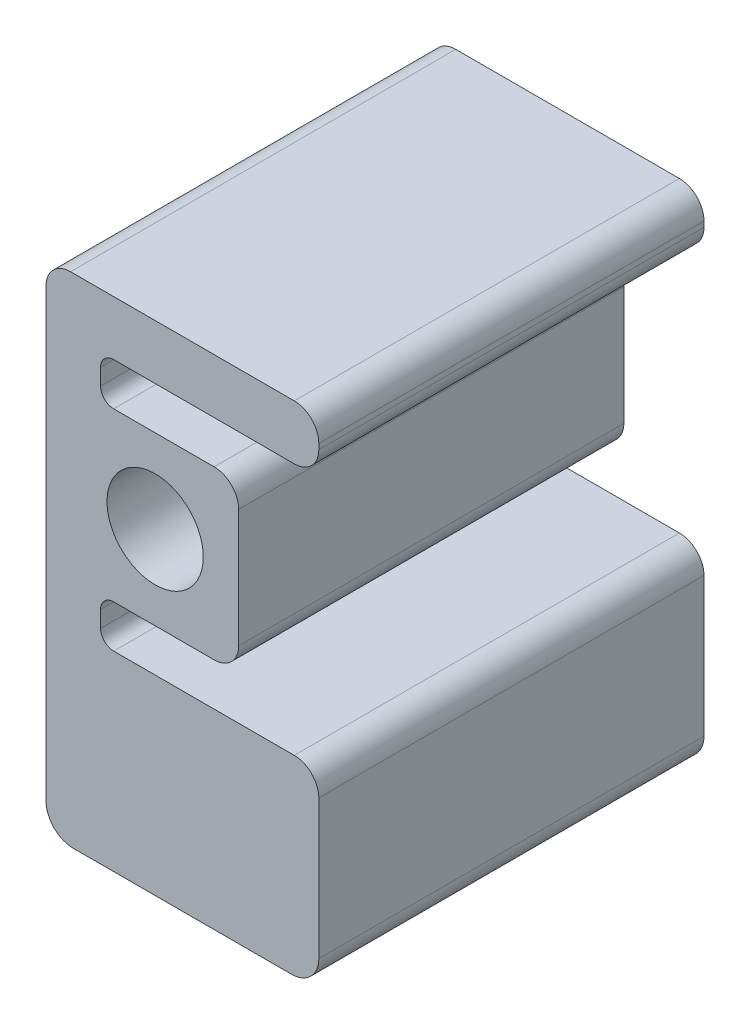
ISO-10303-21;
HEADER;
FILE_DESCRIPTION(('STEP AP214'),'2;1');
FILE_NAME('part.step','',(''),(''),'','','');
FILE_SCHEMA(('AUTOMOTIVE_DESIGN { 1 0 10303 214 1 1 1 1 }'));
ENDSEC;
DATA;
#1=APPLICATION_CONTEXT('core data for automotive mechanical design processes');
#2=APPLICATION_PROTOCOL_DEFINITION('international standard','automotive_design',2000,#1);
#3=PRODUCT_CONTEXT('',#1,'mechanical');
#4=PRODUCT('Part','Part','',(#3));
#5=PRODUCT_RELATED_PRODUCT_CATEGORY('part','',(#4));
#6=PRODUCT_DEFINITION_FORMATION('','',#4);
#7=PRODUCT_DEFINITION_CONTEXT('part definition',#1,'design');
#8=PRODUCT_DEFINITION('design','',#6,#7);
#9=PRODUCT_DEFINITION_SHAPE('','',#8);
#10=(LENGTH_UNIT() NAMED_UNIT(*) SI_UNIT(.MILLI.,.METRE.));
#11=(NAMED_UNIT(*) PLANE_ANGLE_UNIT() SI_UNIT($,.RADIAN.));
#12=(NAMED_UNIT(*) SI_UNIT($,.STERADIAN.) SOLID_ANGLE_UNIT());
#13=UNCERTAINTY_MEASURE_WITH_UNIT(LENGTH_MEASURE(1.E-05),#10,'distance_accuracy_value','');
#14=(GEOMETRIC_REPRESENTATION_CONTEXT(3) GLOBAL_UNCERTAINTY_ASSIGNED_CONTEXT((#13)) GLOBAL_UNIT_ASSIGNED_CONTEXT((#10,
#11,#12)) REPRESENTATION_CONTEXT('',''));
#15=CARTESIAN_POINT('',(0.,0.,0.));
#16=DIRECTION('',(0.,0.,1.));
#17=DIRECTION('',(1.,0.,0.));
#18=AXIS2_PLACEMENT_3D('',#15,#16,#17);
#19=CARTESIAN_POINT('',(-9.65199999999999,-22.503,89.651758212));
#20=DIRECTION('',(0.,0.,-1.));
#21=DIRECTION('',(-1.,0.,0.));
#22=AXIS2_PLACEMENT_3D('',#19,#20,#21);
#23=PLANE('',#22);
#24=DIRECTION('',(1.,0.,0.));
#25=VECTOR('',#24,1.);
#26=CARTESIAN_POINT('',(13.74,-19.455,89.651758212));
#27=LINE('',#26,#25);
#28=CARTESIAN_POINT('',(-9.65199999999999,-19.455,89.651758212));
#29=VERTEX_POINT('',#28);
#30=CARTESIAN_POINT('',(13.74,-19.455,89.651758212));
#31=VERTEX_POINT('',#30);
#32=EDGE_CURVE('E63',#29,#31,#27,.T.);
#33=ORIENTED_EDGE('',*,*,#32,.T.);
#34=CARTESIAN_POINT('',(13.74,-13.74,89.651758212));
#35=DIRECTION('',(0.,0.,1.));
#36=DIRECTION('',(-1.,0.,0.));
#37=AXIS2_PLACEMENT_3D('',#34,#35,#36);
#38=CIRCLE('',#37,5.715);
#39=CARTESIAN_POINT('',(19.455,-13.74,89.651758212));
#40=VERTEX_POINT('',#39);
#41=EDGE_CURVE('E155',#31,#40,#38,.T.);
#42=ORIENTED_EDGE('',*,*,#41,.T.);
#43=DIRECTION('',(0.,1.,0.));
#44=VECTOR('',#43,1.);
#45=CARTESIAN_POINT('',(19.455,0.,89.651758212));
#46=LINE('',#45,#44);
#47=CARTESIAN_POINT('',(19.455,13.74,89.651758212));
#48=VERTEX_POINT('',#47);
#49=EDGE_CURVE('E402',#40,#48,#46,.T.);
#50=ORIENTED_EDGE('',*,*,#49,.T.);
#51=CARTESIAN_POINT('',(13.74,13.74,89.651758212));
#52=DIRECTION('',(0.,0.,1.));
#53=DIRECTION('',(-1.,0.,0.));
#54=AXIS2_PLACEMENT_3D('',#51,#52,#53);
#55=CIRCLE('',#54,5.715);
#56=CARTESIAN_POINT('',(13.74,19.455,89.651758212));
#57=VERTEX_POINT('',#56);
#58=EDGE_CURVE('E422',#48,#57,#55,.T.);
#59=ORIENTED_EDGE('',*,*,#58,.T.);
#60=DIRECTION('',(-1.,0.,0.));
#61=VECTOR('',#60,1.);
#62=CARTESIAN_POINT('',(0.,19.455,89.651758212));
#63=LINE('',#62,#61);
#64=CARTESIAN_POINT('',(-9.65199999999999,19.455,89.651758212));
#65=VERTEX_POINT('',#64);
#66=EDGE_CURVE('E418',#57,#65,#63,.T.);
#67=ORIENTED_EDGE('',*,*,#66,.T.);
#68=CARTESIAN_POINT('',(-9.65199999999999,22.503,89.651758212));
#69=DIRECTION('',(0.,0.,-1.));
#70=DIRECTION('',(-1.,0.,0.));
#71=AXIS2_PLACEMENT_3D('',#68,#69,#70);
#72=CIRCLE('',#71,3.048);
#73=CARTESIAN_POINT('',(-12.7,22.503,89.651758212));
#74=VERTEX_POINT('',#73);
#75=EDGE_CURVE('E421',#65,#74,#72,.T.);
#76=ORIENTED_EDGE('',*,*,#75,.T.);
#77=DIRECTION('',(0.,1.,0.));
#78=VECTOR('',#77,1.);
#79=CARTESIAN_POINT('',(-12.7,22.503,89.651758212));
#80=LINE('',#79,#78);
#81=CARTESIAN_POINT('',(-12.7,26.332,89.651758212));
#82=VERTEX_POINT('',#81);
#83=EDGE_CURVE('E426',#74,#82,#80,.T.);
#84=ORIENTED_EDGE('',*,*,#83,.T.);
#85=CARTESIAN_POINT('',(-9.65199999999999,26.332,89.651758212));
#86=DIRECTION('',(0.,0.,-1.));
#87=DIRECTION('',(-1.,0.,0.));
#88=AXIS2_PLACEMENT_3D('',#85,#86,#87);
#89=CIRCLE('',#88,3.048);
#90=CARTESIAN_POINT('',(-9.65199999999999,29.38,89.651758212));
#91=VERTEX_POINT('',#90);
#92=EDGE_CURVE('E433',#82,#91,#89,.T.);
#93=ORIENTED_EDGE('',*,*,#92,.T.);
#94=DIRECTION('',(1.,0.,0.));
#95=VECTOR('',#94,1.);
#96=CARTESIAN_POINT('',(-9.65199999999999,29.38,89.651758212));
#97=LINE('',#96,#95);
#98=CARTESIAN_POINT('',(32.385,29.38,89.651758212));
#99=VERTEX_POINT('',#98);
#100=EDGE_CURVE('E436',#91,#99,#97,.T.);
#101=ORIENTED_EDGE('',*,*,#100,.T.);
#102=CARTESIAN_POINT('',(32.385,35.095,89.651758212));
#103=DIRECTION('',(0.,0.,1.));
#104=DIRECTION('',(1.,0.,0.));
#105=AXIS2_PLACEMENT_3D('',#102,#103,#104);
#106=CIRCLE('',#105,5.715);
#107=CARTESIAN_POINT('',(38.1,35.095,89.651758212));
#108=VERTEX_POINT('',#107);
#109=EDGE_CURVE('E439',#99,#108,#106,.T.);
#110=ORIENTED_EDGE('',*,*,#109,.T.);
#111=DIRECTION('',(0.,1.,0.));
#112=VECTOR('',#111,1.);
#113=CARTESIAN_POINT('',(38.1,35.095,89.651758212));
#114=LINE('',#113,#112);
#115=CARTESIAN_POINT('',(38.1,36.365,89.651758212));
#116=VERTEX_POINT('',#115);
#117=EDGE_CURVE('E442',#108,#116,#114,.T.);
#118=ORIENTED_EDGE('',*,*,#117,.T.);
#119=CARTESIAN_POINT('',(32.385,36.365,89.651758212));
#120=DIRECTION('',(0.,0.,1.));
#121=DIRECTION('',(1.,0.,0.));
#122=AXIS2_PLACEMENT_3D('',#119,#120,#121);
#123=CIRCLE('',#122,5.715);
#124=CARTESIAN_POINT('',(32.385,42.08,89.651758212));
#125=VERTEX_POINT('',#124);
#126=EDGE_CURVE('E445',#116,#125,#123,.T.);
#127=ORIENTED_EDGE('',*,*,#126,.T.);
#128=DIRECTION('',(-1.,0.,0.));
#129=VECTOR('',#128,1.);
#130=CARTESIAN_POINT('',(32.385,42.08,89.651758212));
#131=LINE('',#130,#129);
#132=CARTESIAN_POINT('',(-19.685,42.08,89.651758212));
#133=VERTEX_POINT('',#132);
#134=EDGE_CURVE('E448',#125,#133,#131,.T.);
#135=ORIENTED_EDGE('',*,*,#134,.T.);
#136=CARTESIAN_POINT('',(-19.685,36.365,89.651758212));
#137=DIRECTION('',(0.,0.,1.));
#138=DIRECTION('',(1.,0.,0.));
#139=AXIS2_PLACEMENT_3D('',#136,#137,#138);
#140=CIRCLE('',#139,5.71499999999999);
#141=CARTESIAN_POINT('',(-25.4,36.365,89.651758212));
#142=VERTEX_POINT('',#141);
#143=EDGE_CURVE('E451',#133,#142,#140,.T.);
#144=ORIENTED_EDGE('',*,*,#143,.T.);
#145=DIRECTION('',(0.,-1.,0.));
#146=VECTOR('',#145,1.);
#147=CARTESIAN_POINT('',(-25.4,-67.4799999619999,89.651758212));
#148=LINE('',#147,#146);
#149=CARTESIAN_POINT('',(-25.4,-67.479999962,89.651758212));
#150=VERTEX_POINT('',#149);
#151=EDGE_CURVE('E454',#142,#150,#148,.T.);
#152=ORIENTED_EDGE('',*,*,#151,.T.);
#153=CARTESIAN_POINT('',(-19.05,-67.479999962,89.651758212));
#154=DIRECTION('',(0.,0.,1.));
#155=DIRECTION('',(-1.,0.,0.));
#156=AXIS2_PLACEMENT_3D('',#153,#154,#155);
#157=CIRCLE('',#156,6.35);
#158=CARTESIAN_POINT('',(-19.0499999999999,-73.829999962,89.651758212));
#159=VERTEX_POINT('',#158);
#160=EDGE_CURVE('E457',#150,#159,#157,.T.);
#161=ORIENTED_EDGE('',*,*,#160,.T.);
#162=DIRECTION('',(1.,0.,0.));
#163=VECTOR('',#162,1.);
#164=CARTESIAN_POINT('',(31.75,-73.829999962,89.651758212));
#165=LINE('',#164,#163);
#166=CARTESIAN_POINT('',(31.75,-73.829999962,89.651758212));
#167=VERTEX_POINT('',#166);
#168=EDGE_CURVE('E460',#159,#167,#165,.T.);
#169=ORIENTED_EDGE('',*,*,#168,.T.);
#170=CARTESIAN_POINT('',(31.75,-67.479999962,89.651758212));
#171=DIRECTION('',(0.,0.,1.));
#172=DIRECTION('',(1.,0.,0.));
#173=AXIS2_PLACEMENT_3D('',#170,#171,#172);
#174=CIRCLE('',#173,6.35);
#175=CARTESIAN_POINT('',(38.1,-67.4799999619999,89.651758212));
#176=VERTEX_POINT('',#175);
#177=EDGE_CURVE('E463',#167,#176,#174,.T.);
#178=ORIENTED_EDGE('',*,*,#177,.T.);
#179=DIRECTION('',(0.,1.,0.));
#180=VECTOR('',#179,1.);
#181=CARTESIAN_POINT('',(38.1,-67.4799999619999,89.651758212));
#182=LINE('',#181,#180);
#183=CARTESIAN_POINT('',(38.1,-35.094999962,89.651758212));
#184=VERTEX_POINT('',#183);
#185=EDGE_CURVE('E466',#176,#184,#182,.T.);
#186=ORIENTED_EDGE('',*,*,#185,.T.);
#187=CARTESIAN_POINT('',(32.385,-35.094999962,89.651758212));
#188=DIRECTION('',(0.,0.,1.));
#189=DIRECTION('',(1.,0.,0.));
#190=AXIS2_PLACEMENT_3D('',#187,#188,#189);
#191=CIRCLE('',#190,5.71499999999999);
#192=CARTESIAN_POINT('',(32.385,-29.379999962,89.651758212));
#193=VERTEX_POINT('',#192);
#194=EDGE_CURVE('E469',#184,#193,#191,.T.);
#195=ORIENTED_EDGE('',*,*,#194,.T.);
#196=DIRECTION('',(-1.,0.,0.));
#197=VECTOR('',#196,1.);
#198=CARTESIAN_POINT('',(32.385,-29.379999962,89.651758212));
#199=LINE('',#198,#197);
#200=CARTESIAN_POINT('',(-9.65199999999999,-29.379999962,89.651758212));
#201=VERTEX_POINT('',#200);
#202=EDGE_CURVE('E223',#193,#201,#199,.T.);
#203=ORIENTED_EDGE('',*,*,#202,.T.);
#204=CARTESIAN_POINT('',(-9.65199999999999,-26.331999962,89.651758212));
#205=DIRECTION('',(0.,0.,-1.));
#206=DIRECTION('',(-1.,0.,0.));
#207=AXIS2_PLACEMENT_3D('',#204,#205,#206);
#208=CIRCLE('',#207,3.048);
#209=CARTESIAN_POINT('',(-12.7,-26.331999962,89.651758212));
#210=VERTEX_POINT('',#209);
#211=EDGE_CURVE('E217',#201,#210,#208,.T.);
#212=ORIENTED_EDGE('',*,*,#211,.T.);
#213=DIRECTION('',(0.,1.,0.));
#214=VECTOR('',#213,1.);
#215=CARTESIAN_POINT('',(-12.7,-26.331999962,89.651758212));
#216=LINE('',#215,#214);
#217=CARTESIAN_POINT('',(-12.7,-22.503,89.651758212));
#218=VERTEX_POINT('',#217);
#219=EDGE_CURVE('E221',#210,#218,#216,.T.);
#220=ORIENTED_EDGE('',*,*,#219,.T.);
#221=CARTESIAN_POINT('',(-9.65199999999999,-22.503,89.651758212));
#222=DIRECTION('',(0.,0.,-1.));
#223=DIRECTION('',(-1.,0.,0.));
#224=AXIS2_PLACEMENT_3D('',#221,#222,#223);
#225=CIRCLE('',#224,3.048);
#226=EDGE_CURVE('E240',#218,#29,#225,.T.);
#227=ORIENTED_EDGE('',*,*,#226,.T.);
#228=EDGE_LOOP('',(#33,#42,#50,#59,#67,#76,#84,#93,#101,#110,#118,#127,#135,#144,#152,#161,#169,
#178,#186,#195,#203,#212,#220,#227));
#229=FACE_BOUND('',#228,.T.);
#230=CARTESIAN_POINT('',(0.,0.,89.651758212));
#231=DIRECTION('',(0.,0.,1.));
#232=DIRECTION('',(1.,0.,0.));
#233=AXIS2_PLACEMENT_3D('',#230,#231,#232);
#234=CIRCLE('',#233,11.2);
#235=CARTESIAN_POINT('',(11.2,0.,89.651758212));
#236=VERTEX_POINT('',#235);
#237=EDGE_CURVE('E252',#236,#236,#234,.T.);
#238=ORIENTED_EDGE('',*,*,#237,.F.);
#239=EDGE_LOOP('',(#238));
#240=FACE_BOUND('',#239,.T.);
#241=ADVANCED_FACE('F45',(#229,#240),#23,.F.);
#242=CARTESIAN_POINT('',(-9.65199999999999,-22.503,0.));
#243=DIRECTION('',(0.,0.,-1.));
#244=DIRECTION('',(-1.,0.,0.));
#245=AXIS2_PLACEMENT_3D('',#242,#243,#244);
#246=PLANE('',#245);
#247=CARTESIAN_POINT('',(13.74,-13.74,0.));
#248=DIRECTION('',(0.,0.,1.));
#249=DIRECTION('',(-1.,0.,0.));
#250=AXIS2_PLACEMENT_3D('',#247,#248,#249);
#251=CIRCLE('',#250,5.715);
#252=CARTESIAN_POINT('',(13.74,-19.455,0.));
#253=VERTEX_POINT('',#252);
#254=CARTESIAN_POINT('',(19.455,-13.74,0.));
#255=VERTEX_POINT('',#254);
#256=EDGE_CURVE('E247',#253,#255,#251,.T.);
#257=ORIENTED_EDGE('',*,*,#256,.F.);
#258=DIRECTION('',(1.,0.,0.));
#259=VECTOR('',#258,1.);
#260=CARTESIAN_POINT('',(-9.65199999999999,-19.455,0.));
#261=LINE('',#260,#259);
#262=CARTESIAN_POINT('',(-9.65199999999999,-19.455,0.));
#263=VERTEX_POINT('',#262);
#264=EDGE_CURVE('E316',#263,#253,#261,.T.);
#265=ORIENTED_EDGE('',*,*,#264,.F.);
#266=CARTESIAN_POINT('',(-9.65199999999999,-22.503,0.));
#267=DIRECTION('',(0.,0.,-1.));
#268=DIRECTION('',(-1.,0.,0.));
#269=AXIS2_PLACEMENT_3D('',#266,#267,#268);
#270=CIRCLE('',#269,3.048);
#271=CARTESIAN_POINT('',(-12.7,-22.503,0.));
#272=VERTEX_POINT('',#271);
#273=EDGE_CURVE('E148',#272,#263,#270,.T.);
#274=ORIENTED_EDGE('',*,*,#273,.F.);
#275=DIRECTION('',(0.,1.,0.));
#276=VECTOR('',#275,1.);
#277=CARTESIAN_POINT('',(-12.7,-26.331999962,0.));
#278=LINE('',#277,#276);
#279=CARTESIAN_POINT('',(-12.7,-26.331999962,0.));
#280=VERTEX_POINT('',#279);
#281=EDGE_CURVE('E141',#280,#272,#278,.T.);
#282=ORIENTED_EDGE('',*,*,#281,.F.);
#283=CARTESIAN_POINT('',(-9.65199999999999,-26.331999962,0.));
#284=DIRECTION('',(0.,0.,-1.));
#285=DIRECTION('',(-1.,0.,0.));
#286=AXIS2_PLACEMENT_3D('',#283,#284,#285);
#287=CIRCLE('',#286,3.048);
#288=CARTESIAN_POINT('',(-9.65199999999999,-29.379999962,0.));
#289=VERTEX_POINT('',#288);
#290=EDGE_CURVE('E232',#289,#280,#287,.T.);
#291=ORIENTED_EDGE('',*,*,#290,.F.);
#292=DIRECTION('',(-1.,0.,0.));
#293=VECTOR('',#292,1.);
#294=CARTESIAN_POINT('',(32.385,-29.379999962,0.));
#295=LINE('',#294,#293);
#296=CARTESIAN_POINT('',(32.385,-29.379999962,0.));
#297=VERTEX_POINT('',#296);
#298=EDGE_CURVE('E307',#297,#289,#295,.T.);
#299=ORIENTED_EDGE('',*,*,#298,.F.);
#300=CARTESIAN_POINT('',(32.385,-35.094999962,0.));
#301=DIRECTION('',(0.,0.,1.));
#302=DIRECTION('',(1.,0.,0.));
#303=AXIS2_PLACEMENT_3D('',#300,#301,#302);
#304=CIRCLE('',#303,5.71499999999999);
#305=CARTESIAN_POINT('',(38.1,-35.094999962,0.));
#306=VERTEX_POINT('',#305);
#307=EDGE_CURVE('E304',#306,#297,#304,.T.);
#308=ORIENTED_EDGE('',*,*,#307,.F.);
#309=DIRECTION('',(0.,1.,0.));
#310=VECTOR('',#309,1.);
#311=CARTESIAN_POINT('',(38.1,-67.4799999619999,0.));
#312=LINE('',#311,#310);
#313=CARTESIAN_POINT('',(38.1,-67.4799999619999,0.));
#314=VERTEX_POINT('',#313);
#315=EDGE_CURVE('E301',#314,#306,#312,.T.);
#316=ORIENTED_EDGE('',*,*,#315,.F.);
#317=CARTESIAN_POINT('',(31.75,-67.479999962,0.));
#318=DIRECTION('',(0.,0.,1.));
#319=DIRECTION('',(1.,0.,0.));
#320=AXIS2_PLACEMENT_3D('',#317,#318,#319);
#321=CIRCLE('',#320,6.35);
#322=CARTESIAN_POINT('',(31.75,-73.829999962,0.));
#323=VERTEX_POINT('',#322);
#324=EDGE_CURVE('E298',#323,#314,#321,.T.);
#325=ORIENTED_EDGE('',*,*,#324,.F.);
#326=DIRECTION('',(1.,0.,0.));
#327=VECTOR('',#326,1.);
#328=CARTESIAN_POINT('',(31.75,-73.829999962,0.));
#329=LINE('',#328,#327);
#330=CARTESIAN_POINT('',(-19.0499999999999,-73.829999962,0.));
#331=VERTEX_POINT('',#330);
#332=EDGE_CURVE('E295',#331,#323,#329,.T.);
#333=ORIENTED_EDGE('',*,*,#332,.F.);
#334=CARTESIAN_POINT('',(-19.05,-67.479999962,0.));
#335=DIRECTION('',(0.,0.,1.));
#336=DIRECTION('',(-1.,0.,0.));
#337=AXIS2_PLACEMENT_3D('',#334,#335,#336);
#338=CIRCLE('',#337,6.35);
#339=CARTESIAN_POINT('',(-25.4,-67.479999962,0.));
#340=VERTEX_POINT('',#339);
#341=EDGE_CURVE('E292',#340,#331,#338,.T.);
#342=ORIENTED_EDGE('',*,*,#341,.F.);
#343=DIRECTION('',(0.,-1.,0.));
#344=VECTOR('',#343,1.);
#345=CARTESIAN_POINT('',(-25.4,-67.4799999619999,0.));
#346=LINE('',#345,#344);
#347=CARTESIAN_POINT('',(-25.4,36.365,0.));
#348=VERTEX_POINT('',#347);
#349=EDGE_CURVE('E289',#348,#340,#346,.T.);
#350=ORIENTED_EDGE('',*,*,#349,.F.);
#351=CARTESIAN_POINT('',(-19.685,36.365,0.));
#352=DIRECTION('',(0.,0.,1.));
#353=DIRECTION('',(1.,0.,0.));
#354=AXIS2_PLACEMENT_3D('',#351,#352,#353);
#355=CIRCLE('',#354,5.71499999999999);
#356=CARTESIAN_POINT('',(-19.685,42.08,0.));
#357=VERTEX_POINT('',#356);
#358=EDGE_CURVE('E286',#357,#348,#355,.T.);
#359=ORIENTED_EDGE('',*,*,#358,.F.);
#360=DIRECTION('',(-1.,0.,0.));
#361=VECTOR('',#360,1.);
#362=CARTESIAN_POINT('',(32.385,42.08,0.));
#363=LINE('',#362,#361);
#364=CARTESIAN_POINT('',(32.385,42.08,0.));
#365=VERTEX_POINT('',#364);
#366=EDGE_CURVE('E283',#365,#357,#363,.T.);
#367=ORIENTED_EDGE('',*,*,#366,.F.);
#368=CARTESIAN_POINT('',(32.385,36.365,0.));
#369=DIRECTION('',(0.,0.,1.));
#370=DIRECTION('',(1.,0.,0.));
#371=AXIS2_PLACEMENT_3D('',#368,#369,#370);
#372=CIRCLE('',#371,5.715);
#373=CARTESIAN_POINT('',(38.1,36.365,0.));
#374=VERTEX_POINT('',#373);
#375=EDGE_CURVE('E280',#374,#365,#372,.T.);
#376=ORIENTED_EDGE('',*,*,#375,.F.);
#377=DIRECTION('',(0.,1.,0.));
#378=VECTOR('',#377,1.);
#379=CARTESIAN_POINT('',(38.1,35.095,0.));
#380=LINE('',#379,#378);
#381=CARTESIAN_POINT('',(38.1,35.095,0.));
#382=VERTEX_POINT('',#381);
#383=EDGE_CURVE('E277',#382,#374,#380,.T.);
#384=ORIENTED_EDGE('',*,*,#383,.F.);
#385=CARTESIAN_POINT('',(32.385,35.095,0.));
#386=DIRECTION('',(0.,0.,1.));
#387=DIRECTION('',(1.,0.,0.));
#388=AXIS2_PLACEMENT_3D('',#385,#386,#387);
#389=CIRCLE('',#388,5.715);
#390=CARTESIAN_POINT('',(32.385,29.38,0.));
#391=VERTEX_POINT('',#390);
#392=EDGE_CURVE('E274',#391,#382,#389,.T.);
#393=ORIENTED_EDGE('',*,*,#392,.F.);
#394=DIRECTION('',(1.,0.,0.));
#395=VECTOR('',#394,1.);
#396=CARTESIAN_POINT('',(-9.65199999999999,29.38,0.));
#397=LINE('',#396,#395);
#398=CARTESIAN_POINT('',(-9.65199999999999,29.38,0.));
#399=VERTEX_POINT('',#398);
#400=EDGE_CURVE('E271',#399,#391,#397,.T.);
#401=ORIENTED_EDGE('',*,*,#400,.F.);
#402=CARTESIAN_POINT('',(-9.65199999999999,26.332,0.));
#403=DIRECTION('',(0.,0.,-1.));
#404=DIRECTION('',(-1.,0.,0.));
#405=AXIS2_PLACEMENT_3D('',#402,#403,#404);
#406=CIRCLE('',#405,3.048);
#407=CARTESIAN_POINT('',(-12.7,26.332,0.));
#408=VERTEX_POINT('',#407);
#409=EDGE_CURVE('E268',#408,#399,#406,.T.);
#410=ORIENTED_EDGE('',*,*,#409,.F.);
#411=DIRECTION('',(0.,1.,0.));
#412=VECTOR('',#411,1.);
#413=CARTESIAN_POINT('',(-12.7,22.503,0.));
#414=LINE('',#413,#412);
#415=CARTESIAN_POINT('',(-12.7,22.503,0.));
#416=VERTEX_POINT('',#415);
#417=EDGE_CURVE('E265',#416,#408,#414,.T.);
#418=ORIENTED_EDGE('',*,*,#417,.F.);
#419=CARTESIAN_POINT('',(-9.65199999999999,22.503,0.));
#420=DIRECTION('',(0.,0.,-1.));
#421=DIRECTION('',(-1.,0.,0.));
#422=AXIS2_PLACEMENT_3D('',#419,#420,#421);
#423=CIRCLE('',#422,3.048);
#424=CARTESIAN_POINT('',(-9.65199999999999,19.455,0.));
#425=VERTEX_POINT('',#424);
#426=EDGE_CURVE('E262',#425,#416,#423,.T.);
#427=ORIENTED_EDGE('',*,*,#426,.F.);
#428=DIRECTION('',(-1.,0.,0.));
#429=VECTOR('',#428,1.);
#430=CARTESIAN_POINT('',(-9.65199999999999,19.455,0.));
#431=LINE('',#430,#429);
#432=CARTESIAN_POINT('',(13.74,19.455,0.));
#433=VERTEX_POINT('',#432);
#434=EDGE_CURVE('E259',#433,#425,#431,.T.);
#435=ORIENTED_EDGE('',*,*,#434,.F.);
#436=CARTESIAN_POINT('',(13.74,13.74,0.));
#437=DIRECTION('',(0.,0.,1.));
#438=DIRECTION('',(-1.,0.,0.));
#439=AXIS2_PLACEMENT_3D('',#436,#437,#438);
#440=CIRCLE('',#439,5.715);
#441=CARTESIAN_POINT('',(19.455,13.74,0.));
#442=VERTEX_POINT('',#441);
#443=EDGE_CURVE('E255',#442,#433,#440,.T.);
#444=ORIENTED_EDGE('',*,*,#443,.F.);
#445=DIRECTION('',(0.,1.,0.));
#446=VECTOR('',#445,1.);
#447=CARTESIAN_POINT('',(19.455,13.74,0.));
#448=LINE('',#447,#446);
#449=EDGE_CURVE('E251',#255,#442,#448,.T.);
#450=ORIENTED_EDGE('',*,*,#449,.F.);
#451=EDGE_LOOP('',(#257,#265,#274,#282,#291,#299,#308,#316,#325,#333,#342,#350,#359,#367,#376,
#384,#393,#401,#410,#418,#427,#435,#444,#450));
#452=FACE_BOUND('',#451,.T.);
#453=CARTESIAN_POINT('',(0.,0.,0.));
#454=DIRECTION('',(0.,0.,1.));
#455=DIRECTION('',(1.,0.,0.));
#456=AXIS2_PLACEMENT_3D('',#453,#454,#455);
#457=CIRCLE('',#456,11.2);
#458=CARTESIAN_POINT('',(11.2,0.,0.));
#459=VERTEX_POINT('',#458);
#460=EDGE_CURVE('E780',#459,#459,#457,.T.);
#461=ORIENTED_EDGE('',*,*,#460,.T.);
#462=EDGE_LOOP('',(#461));
#463=FACE_BOUND('',#462,.T.);
#464=ADVANCED_FACE('F406',(#452,#463),#246,.T.);
#465=CARTESIAN_POINT('',(13.74,-13.74,89.651758212));
#466=DIRECTION('',(0.,0.,-1.));
#467=DIRECTION('',(-1.,0.,0.));
#468=AXIS2_PLACEMENT_3D('',#465,#466,#467);
#469=CYLINDRICAL_SURFACE('',#468,5.715);
#470=ORIENTED_EDGE('',*,*,#256,.T.);
#471=DIRECTION('',(0.,0.,-1.));
#472=VECTOR('',#471,1.);
#473=CARTESIAN_POINT('',(19.455,-13.74,89.651758212));
#474=LINE('',#473,#472);
#475=EDGE_CURVE('E55',#40,#255,#474,.T.);
#476=ORIENTED_EDGE('',*,*,#475,.F.);
#477=ORIENTED_EDGE('',*,*,#41,.F.);
#478=DIRECTION('',(0.,0.,-1.));
#479=VECTOR('',#478,1.);
#480=CARTESIAN_POINT('',(13.74,-19.455,89.651758212));
#481=LINE('',#480,#479);
#482=EDGE_CURVE('E11',#31,#253,#481,.T.);
#483=ORIENTED_EDGE('',*,*,#482,.T.);
#484=EDGE_LOOP('',(#470,#476,#477,#483));
#485=FACE_BOUND('',#484,.T.);
#486=ADVANCED_FACE('F47',(#485),#469,.T.);
#487=CARTESIAN_POINT('',(19.455,13.74,89.651758212));
#488=DIRECTION('',(-1.,0.,0.));
#489=DIRECTION('',(0.,0.,1.));
#490=AXIS2_PLACEMENT_3D('',#487,#488,#489);
#491=PLANE('',#490);
#492=ORIENTED_EDGE('',*,*,#449,.T.);
#493=DIRECTION('',(0.,0.,-1.));
#494=VECTOR('',#493,1.);
#495=CARTESIAN_POINT('',(19.455,13.74,89.651758212));
#496=LINE('',#495,#494);
#497=EDGE_CURVE('E393',#48,#442,#496,.T.);
#498=ORIENTED_EDGE('',*,*,#497,.F.);
#499=ORIENTED_EDGE('',*,*,#49,.F.);
#500=ORIENTED_EDGE('',*,*,#475,.T.);
#501=EDGE_LOOP('',(#492,#498,#499,#500));
#502=FACE_BOUND('',#501,.T.);
#503=ADVANCED_FACE('F400',(#502),#491,.F.);
#504=CARTESIAN_POINT('',(13.74,13.74,89.651758212));
#505=DIRECTION('',(0.,0.,-1.));
#506=DIRECTION('',(-1.,0.,0.));
#507=AXIS2_PLACEMENT_3D('',#504,#505,#506);
#508=CYLINDRICAL_SURFACE('',#507,5.715);
#509=ORIENTED_EDGE('',*,*,#443,.T.);
#510=DIRECTION('',(0.,0.,-1.));
#511=VECTOR('',#510,1.);
#512=CARTESIAN_POINT('',(13.74,19.455,89.651758212));
#513=LINE('',#512,#511);
#514=EDGE_CURVE('E389',#57,#433,#513,.T.);
#515=ORIENTED_EDGE('',*,*,#514,.F.);
#516=ORIENTED_EDGE('',*,*,#58,.F.);
#517=ORIENTED_EDGE('',*,*,#497,.T.);
#518=EDGE_LOOP('',(#509,#515,#516,#517));
#519=FACE_BOUND('',#518,.T.);
#520=ADVANCED_FACE('F412',(#519),#508,.T.);
#521=CARTESIAN_POINT('',(-9.65199999999999,19.455,89.651758212));
#522=DIRECTION('',(0.,-1.,0.));
#523=DIRECTION('',(1.,0.,0.));
#524=AXIS2_PLACEMENT_3D('',#521,#522,#523);
#525=PLANE('',#524);
#526=ORIENTED_EDGE('',*,*,#434,.T.);
#527=DIRECTION('',(0.,0.,-1.));
#528=VECTOR('',#527,1.);
#529=CARTESIAN_POINT('',(-9.65199999999999,19.455,89.651758212));
#530=LINE('',#529,#528);
#531=EDGE_CURVE('E385',#65,#425,#530,.T.);
#532=ORIENTED_EDGE('',*,*,#531,.F.);
#533=ORIENTED_EDGE('',*,*,#66,.F.);
#534=ORIENTED_EDGE('',*,*,#514,.T.);
#535=EDGE_LOOP('',(#526,#532,#533,#534));
#536=FACE_BOUND('',#535,.T.);
#537=ADVANCED_FACE('F416',(#536),#525,.F.);
#538=CARTESIAN_POINT('',(-9.65199999999999,22.503,89.651758212));
#539=DIRECTION('',(0.,0.,-1.));
#540=DIRECTION('',(-1.,0.,0.));
#541=AXIS2_PLACEMENT_3D('',#538,#539,#540);
#542=CYLINDRICAL_SURFACE('',#541,3.048);
#543=ORIENTED_EDGE('',*,*,#426,.T.);
#544=DIRECTION('',(0.,0.,-1.));
#545=VECTOR('',#544,1.);
#546=CARTESIAN_POINT('',(-12.7,22.503,89.651758212));
#547=LINE('',#546,#545);
#548=EDGE_CURVE('E381',#74,#416,#547,.T.);
#549=ORIENTED_EDGE('',*,*,#548,.F.);
#550=ORIENTED_EDGE('',*,*,#75,.F.);
#551=ORIENTED_EDGE('',*,*,#531,.T.);
#552=EDGE_LOOP('',(#543,#549,#550,#551));
#553=FACE_BOUND('',#552,.T.);
#554=ADVANCED_FACE('F547',(#553),#542,.F.);
#555=CARTESIAN_POINT('',(-12.7,22.503,89.651758212));
#556=DIRECTION('',(-1.,0.,0.));
#557=DIRECTION('',(0.,0.,1.));
#558=AXIS2_PLACEMENT_3D('',#555,#556,#557);
#559=PLANE('',#558);
#560=ORIENTED_EDGE('',*,*,#417,.T.);
#561=DIRECTION('',(0.,0.,-1.));
#562=VECTOR('',#561,1.);
#563=CARTESIAN_POINT('',(-12.7,26.332,89.651758212));
#564=LINE('',#563,#562);
#565=EDGE_CURVE('E377',#82,#408,#564,.T.);
#566=ORIENTED_EDGE('',*,*,#565,.F.);
#567=ORIENTED_EDGE('',*,*,#83,.F.);
#568=ORIENTED_EDGE('',*,*,#548,.T.);
#569=EDGE_LOOP('',(#560,#566,#567,#568));
#570=FACE_BOUND('',#569,.T.);
#571=ADVANCED_FACE('F543',(#570),#559,.F.);
#572=CARTESIAN_POINT('',(-9.65199999999999,26.332,89.651758212));
#573=DIRECTION('',(0.,0.,-1.));
#574=DIRECTION('',(-1.,0.,0.));
#575=AXIS2_PLACEMENT_3D('',#572,#573,#574);
#576=CYLINDRICAL_SURFACE('',#575,3.048);
#577=ORIENTED_EDGE('',*,*,#409,.T.);
#578=DIRECTION('',(0.,0.,-1.));
#579=VECTOR('',#578,1.);
#580=CARTESIAN_POINT('',(-9.65199999999999,29.38,89.651758212));
#581=LINE('',#580,#579);
#582=EDGE_CURVE('E373',#91,#399,#581,.T.);
#583=ORIENTED_EDGE('',*,*,#582,.F.);
#584=ORIENTED_EDGE('',*,*,#92,.F.);
#585=ORIENTED_EDGE('',*,*,#565,.T.);
#586=EDGE_LOOP('',(#577,#583,#584,#585));
#587=FACE_BOUND('',#586,.T.);
#588=ADVANCED_FACE('F539',(#587),#576,.F.);
#589=CARTESIAN_POINT('',(-9.65199999999999,29.38,89.651758212));
#590=DIRECTION('',(0.,1.,0.));
#591=DIRECTION('',(0.,0.,1.));
#592=AXIS2_PLACEMENT_3D('',#589,#590,#591);
#593=PLANE('',#592);
#594=ORIENTED_EDGE('',*,*,#400,.T.);
#595=DIRECTION('',(0.,0.,-1.));
#596=VECTOR('',#595,1.);
#597=CARTESIAN_POINT('',(32.385,29.38,89.651758212));
#598=LINE('',#597,#596);
#599=EDGE_CURVE('E369',#99,#391,#598,.T.);
#600=ORIENTED_EDGE('',*,*,#599,.F.);
#601=ORIENTED_EDGE('',*,*,#100,.F.);
#602=ORIENTED_EDGE('',*,*,#582,.T.);
#603=EDGE_LOOP('',(#594,#600,#601,#602));
#604=FACE_BOUND('',#603,.T.);
#605=ADVANCED_FACE('F535',(#604),#593,.F.);
#606=CARTESIAN_POINT('',(32.385,35.095,89.651758212));
#607=DIRECTION('',(0.,0.,-1.));
#608=DIRECTION('',(-1.,0.,0.));
#609=AXIS2_PLACEMENT_3D('',#606,#607,#608);
#610=CYLINDRICAL_SURFACE('',#609,5.715);
#611=ORIENTED_EDGE('',*,*,#392,.T.);
#612=DIRECTION('',(0.,0.,-1.));
#613=VECTOR('',#612,1.);
#614=CARTESIAN_POINT('',(38.1,35.095,89.651758212));
#615=LINE('',#614,#613);
#616=EDGE_CURVE('E365',#108,#382,#615,.T.);
#617=ORIENTED_EDGE('',*,*,#616,.F.);
#618=ORIENTED_EDGE('',*,*,#109,.F.);
#619=ORIENTED_EDGE('',*,*,#599,.T.);
#620=EDGE_LOOP('',(#611,#617,#618,#619));
#621=FACE_BOUND('',#620,.T.);
#622=ADVANCED_FACE('F530',(#621),#610,.T.);
#623=CARTESIAN_POINT('',(38.1,35.095,89.651758212));
#624=DIRECTION('',(-1.,0.,0.));
#625=DIRECTION('',(0.,-1.,0.));
#626=AXIS2_PLACEMENT_3D('',#623,#624,#625);
#627=PLANE('',#626);
#628=ORIENTED_EDGE('',*,*,#383,.T.);
#629=DIRECTION('',(0.,0.,-1.));
#630=VECTOR('',#629,1.);
#631=CARTESIAN_POINT('',(38.1,36.365,89.651758212));
#632=LINE('',#631,#630);
#633=EDGE_CURVE('E361',#116,#374,#632,.T.);
#634=ORIENTED_EDGE('',*,*,#633,.F.);
#635=ORIENTED_EDGE('',*,*,#117,.F.);
#636=ORIENTED_EDGE('',*,*,#616,.T.);
#637=EDGE_LOOP('',(#628,#634,#635,#636));
#638=FACE_BOUND('',#637,.T.);
#639=ADVANCED_FACE('F524',(#638),#627,.F.);
#640=CARTESIAN_POINT('',(32.385,36.365,89.651758212));
#641=DIRECTION('',(0.,0.,-1.));
#642=DIRECTION('',(-1.,0.,0.));
#643=AXIS2_PLACEMENT_3D('',#640,#641,#642);
#644=CYLINDRICAL_SURFACE('',#643,5.715);
#645=ORIENTED_EDGE('',*,*,#375,.T.);
#646=DIRECTION('',(0.,0.,-1.));
#647=VECTOR('',#646,1.);
#648=CARTESIAN_POINT('',(32.385,42.08,89.651758212));
#649=LINE('',#648,#647);
#650=EDGE_CURVE('E357',#125,#365,#649,.T.);
#651=ORIENTED_EDGE('',*,*,#650,.F.);
#652=ORIENTED_EDGE('',*,*,#126,.F.);
#653=ORIENTED_EDGE('',*,*,#633,.T.);
#654=EDGE_LOOP('',(#645,#651,#652,#653));
#655=FACE_BOUND('',#654,.T.);
#656=ADVANCED_FACE('F520',(#655),#644,.T.);
#657=CARTESIAN_POINT('',(32.385,42.08,89.651758212));
#658=DIRECTION('',(0.,-1.,0.));
#659=DIRECTION('',(1.,0.,0.));
#660=AXIS2_PLACEMENT_3D('',#657,#658,#659);
#661=PLANE('',#660);
#662=ORIENTED_EDGE('',*,*,#366,.T.);
#663=DIRECTION('',(0.,0.,-1.));
#664=VECTOR('',#663,1.);
#665=CARTESIAN_POINT('',(-19.685,42.08,89.651758212));
#666=LINE('',#665,#664);
#667=EDGE_CURVE('E353',#133,#357,#666,.T.);
#668=ORIENTED_EDGE('',*,*,#667,.F.);
#669=ORIENTED_EDGE('',*,*,#134,.F.);
#670=ORIENTED_EDGE('',*,*,#650,.T.);
#671=EDGE_LOOP('',(#662,#668,#669,#670));
#672=FACE_BOUND('',#671,.T.);
#673=ADVANCED_FACE('F515',(#672),#661,.F.);
#674=CARTESIAN_POINT('',(-19.685,36.365,89.651758212));
#675=DIRECTION('',(0.,0.,-1.));
#676=DIRECTION('',(-1.,0.,0.));
#677=AXIS2_PLACEMENT_3D('',#674,#675,#676);
#678=CYLINDRICAL_SURFACE('',#677,5.71499999999999);
#679=ORIENTED_EDGE('',*,*,#358,.T.);
#680=DIRECTION('',(0.,0.,-1.));
#681=VECTOR('',#680,1.);
#682=CARTESIAN_POINT('',(-25.4,36.365,89.651758212));
#683=LINE('',#682,#681);
#684=EDGE_CURVE('E349',#142,#348,#683,.T.);
#685=ORIENTED_EDGE('',*,*,#684,.F.);
#686=ORIENTED_EDGE('',*,*,#143,.F.);
#687=ORIENTED_EDGE('',*,*,#667,.T.);
#688=EDGE_LOOP('',(#679,#685,#686,#687));
#689=FACE_BOUND('',#688,.T.);
#690=ADVANCED_FACE('F509',(#689),#678,.T.);
#691=CARTESIAN_POINT('',(-25.4,-67.4799999619999,89.651758212));
#692=DIRECTION('',(1.,0.,0.));
#693=DIRECTION('',(0.,1.,0.));
#694=AXIS2_PLACEMENT_3D('',#691,#692,#693);
#695=PLANE('',#694);
#696=ORIENTED_EDGE('',*,*,#349,.T.);
#697=DIRECTION('',(0.,0.,-1.));
#698=VECTOR('',#697,1.);
#699=CARTESIAN_POINT('',(-25.4,-67.479999962,89.651758212));
#700=LINE('',#699,#698);
#701=EDGE_CURVE('E345',#150,#340,#700,.T.);
#702=ORIENTED_EDGE('',*,*,#701,.F.);
#703=ORIENTED_EDGE('',*,*,#151,.F.);
#704=ORIENTED_EDGE('',*,*,#684,.T.);
#705=EDGE_LOOP('',(#696,#702,#703,#704));
#706=FACE_BOUND('',#705,.T.);
#707=ADVANCED_FACE('F505',(#706),#695,.F.);
#708=CARTESIAN_POINT('',(-19.05,-67.479999962,89.651758212));
#709=DIRECTION('',(0.,0.,-1.));
#710=DIRECTION('',(-1.,0.,0.));
#711=AXIS2_PLACEMENT_3D('',#708,#709,#710);
#712=CYLINDRICAL_SURFACE('',#711,6.35);
#713=ORIENTED_EDGE('',*,*,#341,.T.);
#714=DIRECTION('',(0.,0.,-1.));
#715=VECTOR('',#714,1.);
#716=CARTESIAN_POINT('',(-19.0499999999999,-73.829999962,89.651758212));
#717=LINE('',#716,#715);
#718=EDGE_CURVE('E341',#159,#331,#717,.T.);
#719=ORIENTED_EDGE('',*,*,#718,.F.);
#720=ORIENTED_EDGE('',*,*,#160,.F.);
#721=ORIENTED_EDGE('',*,*,#701,.T.);
#722=EDGE_LOOP('',(#713,#719,#720,#721));
#723=FACE_BOUND('',#722,.T.);
#724=ADVANCED_FACE('F500',(#723),#712,.T.);
#725=CARTESIAN_POINT('',(31.75,-73.829999962,89.651758212));
#726=DIRECTION('',(0.,1.,0.));
#727=DIRECTION('',(0.,0.,1.));
#728=AXIS2_PLACEMENT_3D('',#725,#726,#727);
#729=PLANE('',#728);
#730=ORIENTED_EDGE('',*,*,#332,.T.);
#731=DIRECTION('',(0.,0.,-1.));
#732=VECTOR('',#731,1.);
#733=CARTESIAN_POINT('',(31.75,-73.829999962,89.651758212));
#734=LINE('',#733,#732);
#735=EDGE_CURVE('E337',#167,#323,#734,.T.);
#736=ORIENTED_EDGE('',*,*,#735,.F.);
#737=ORIENTED_EDGE('',*,*,#168,.F.);
#738=ORIENTED_EDGE('',*,*,#718,.T.);
#739=EDGE_LOOP('',(#730,#736,#737,#738));
#740=FACE_BOUND('',#739,.T.);
#741=ADVANCED_FACE('F494',(#740),#729,.F.);
#742=CARTESIAN_POINT('',(31.75,-67.479999962,89.651758212));
#743=DIRECTION('',(0.,0.,-1.));
#744=DIRECTION('',(-1.,0.,0.));
#745=AXIS2_PLACEMENT_3D('',#742,#743,#744);
#746=CYLINDRICAL_SURFACE('',#745,6.35);
#747=ORIENTED_EDGE('',*,*,#324,.T.);
#748=DIRECTION('',(0.,0.,-1.));
#749=VECTOR('',#748,1.);
#750=CARTESIAN_POINT('',(38.1,-67.4799999619999,89.651758212));
#751=LINE('',#750,#749);
#752=EDGE_CURVE('E333',#176,#314,#751,.T.);
#753=ORIENTED_EDGE('',*,*,#752,.F.);
#754=ORIENTED_EDGE('',*,*,#177,.F.);
#755=ORIENTED_EDGE('',*,*,#735,.T.);
#756=EDGE_LOOP('',(#747,#753,#754,#755));
#757=FACE_BOUND('',#756,.T.);
#758=ADVANCED_FACE('F490',(#757),#746,.T.);
#759=CARTESIAN_POINT('',(38.1,-67.4799999619999,89.651758212));
#760=DIRECTION('',(-1.,0.,0.));
#761=DIRECTION('',(0.,-1.,0.));
#762=AXIS2_PLACEMENT_3D('',#759,#760,#761);
#763=PLANE('',#762);
#764=ORIENTED_EDGE('',*,*,#315,.T.);
#765=DIRECTION('',(0.,0.,-1.));
#766=VECTOR('',#765,1.);
#767=CARTESIAN_POINT('',(38.1,-35.094999962,89.651758212));
#768=LINE('',#767,#766);
#769=EDGE_CURVE('E329',#184,#306,#768,.T.);
#770=ORIENTED_EDGE('',*,*,#769,.F.);
#771=ORIENTED_EDGE('',*,*,#185,.F.);
#772=ORIENTED_EDGE('',*,*,#752,.T.);
#773=EDGE_LOOP('',(#764,#770,#771,#772));
#774=FACE_BOUND('',#773,.T.);
#775=ADVANCED_FACE('F486',(#774),#763,.F.);
#776=CARTESIAN_POINT('',(32.385,-35.094999962,89.651758212));
#777=DIRECTION('',(0.,0.,-1.));
#778=DIRECTION('',(-1.,0.,0.));
#779=AXIS2_PLACEMENT_3D('',#776,#777,#778);
#780=CYLINDRICAL_SURFACE('',#779,5.71499999999999);
#781=ORIENTED_EDGE('',*,*,#307,.T.);
#782=DIRECTION('',(0.,0.,-1.));
#783=VECTOR('',#782,1.);
#784=CARTESIAN_POINT('',(32.385,-29.379999962,89.651758212));
#785=LINE('',#784,#783);
#786=EDGE_CURVE('E325',#193,#297,#785,.T.);
#787=ORIENTED_EDGE('',*,*,#786,.F.);
#788=ORIENTED_EDGE('',*,*,#194,.F.);
#789=ORIENTED_EDGE('',*,*,#769,.T.);
#790=EDGE_LOOP('',(#781,#787,#788,#789));
#791=FACE_BOUND('',#790,.T.);
#792=ADVANCED_FACE('F477',(#791),#780,.T.);
#793=CARTESIAN_POINT('',(32.385,-29.379999962,89.651758212));
#794=DIRECTION('',(0.,-1.,0.));
#795=DIRECTION('',(1.,0.,0.));
#796=AXIS2_PLACEMENT_3D('',#793,#794,#795);
#797=PLANE('',#796);
#798=ORIENTED_EDGE('',*,*,#298,.T.);
#799=DIRECTION('',(0.,0.,-1.));
#800=VECTOR('',#799,1.);
#801=CARTESIAN_POINT('',(-9.65199999999999,-29.379999962,89.651758212));
#802=LINE('',#801,#800);
#803=EDGE_CURVE('E234',#201,#289,#802,.T.);
#804=ORIENTED_EDGE('',*,*,#803,.F.);
#805=ORIENTED_EDGE('',*,*,#202,.F.);
#806=ORIENTED_EDGE('',*,*,#786,.T.);
#807=EDGE_LOOP('',(#798,#804,#805,#806));
#808=FACE_BOUND('',#807,.T.);
#809=ADVANCED_FACE('F481',(#808),#797,.F.);
#810=CARTESIAN_POINT('',(-9.65199999999999,-26.331999962,89.651758212));
#811=DIRECTION('',(0.,0.,-1.));
#812=DIRECTION('',(-1.,0.,0.));
#813=AXIS2_PLACEMENT_3D('',#810,#811,#812);
#814=CYLINDRICAL_SURFACE('',#813,3.048);
#815=ORIENTED_EDGE('',*,*,#290,.T.);
#816=DIRECTION('',(0.,0.,-1.));
#817=VECTOR('',#816,1.);
#818=CARTESIAN_POINT('',(-12.7,-26.331999962,89.651758212));
#819=LINE('',#818,#817);
#820=EDGE_CURVE('E229',#210,#280,#819,.T.);
#821=ORIENTED_EDGE('',*,*,#820,.F.);
#822=ORIENTED_EDGE('',*,*,#211,.F.);
#823=ORIENTED_EDGE('',*,*,#803,.T.);
#824=EDGE_LOOP('',(#815,#821,#822,#823));
#825=FACE_BOUND('',#824,.T.);
#826=ADVANCED_FACE('F230',(#825),#814,.F.);
#827=CARTESIAN_POINT('',(-12.7,-26.331999962,89.651758212));
#828=DIRECTION('',(-1.,0.,0.));
#829=DIRECTION('',(0.,0.,1.));
#830=AXIS2_PLACEMENT_3D('',#827,#828,#829);
#831=PLANE('',#830);
#832=ORIENTED_EDGE('',*,*,#281,.T.);
#833=DIRECTION('',(0.,0.,-1.));
#834=VECTOR('',#833,1.);
#835=CARTESIAN_POINT('',(-12.7,-22.503,89.651758212));
#836=LINE('',#835,#834);
#837=EDGE_CURVE('E235',#218,#272,#836,.T.);
#838=ORIENTED_EDGE('',*,*,#837,.F.);
#839=ORIENTED_EDGE('',*,*,#219,.F.);
#840=ORIENTED_EDGE('',*,*,#820,.T.);
#841=EDGE_LOOP('',(#832,#838,#839,#840));
#842=FACE_BOUND('',#841,.T.);
#843=ADVANCED_FACE('F237',(#842),#831,.F.);
#844=CARTESIAN_POINT('',(-9.65199999999999,-22.503,89.651758212));
#845=DIRECTION('',(0.,0.,-1.));
#846=DIRECTION('',(-1.,0.,0.));
#847=AXIS2_PLACEMENT_3D('',#844,#845,#846);
#848=CYLINDRICAL_SURFACE('',#847,3.048);
#849=ORIENTED_EDGE('',*,*,#273,.T.);
#850=DIRECTION('',(0.,0.,-1.));
#851=VECTOR('',#850,1.);
#852=CARTESIAN_POINT('',(-9.65199999999999,-19.455,89.651758212));
#853=LINE('',#852,#851);
#854=EDGE_CURVE('E243',#29,#263,#853,.T.);
#855=ORIENTED_EDGE('',*,*,#854,.F.);
#856=ORIENTED_EDGE('',*,*,#226,.F.);
#857=ORIENTED_EDGE('',*,*,#837,.T.);
#858=EDGE_LOOP('',(#849,#855,#856,#857));
#859=FACE_BOUND('',#858,.T.);
#860=ADVANCED_FACE('F568',(#859),#848,.F.);
#861=CARTESIAN_POINT('',(-9.65199999999999,-19.455,89.651758212));
#862=DIRECTION('',(0.,1.,0.));
#863=DIRECTION('',(-1.,0.,0.));
#864=AXIS2_PLACEMENT_3D('',#861,#862,#863);
#865=PLANE('',#864);
#866=ORIENTED_EDGE('',*,*,#264,.T.);
#867=ORIENTED_EDGE('',*,*,#482,.F.);
#868=ORIENTED_EDGE('',*,*,#32,.F.);
#869=ORIENTED_EDGE('',*,*,#854,.T.);
#870=EDGE_LOOP('',(#866,#867,#868,#869));
#871=FACE_BOUND('',#870,.T.);
#872=ADVANCED_FACE('F565',(#871),#865,.F.);
#873=CARTESIAN_POINT('',(0.,0.,89.651758212));
#874=DIRECTION('',(0.,0.,-1.));
#875=DIRECTION('',(-1.,0.,0.));
#876=AXIS2_PLACEMENT_3D('',#873,#874,#875);
#877=CYLINDRICAL_SURFACE('',#876,11.2);
#878=ORIENTED_EDGE('',*,*,#237,.T.);
#879=EDGE_LOOP('',(#878));
#880=FACE_BOUND('',#879,.T.);
#881=ORIENTED_EDGE('',*,*,#460,.F.);
#882=EDGE_LOOP('',(#881));
#883=FACE_BOUND('',#882,.T.);
#884=ADVANCED_FACE('F563',(#880,#883),#877,.F.);
#885=CLOSED_SHELL('',(#241,#464,#486,#503,#520,#537,#554,#571,#588,#605,#622,#639,#656,#673,
#690,#707,#724,#741,#758,#775,#792,#809,#826,#843,#860,#872,#884));
#886=MANIFOLD_SOLID_BREP('B2',#885);
#887=ADVANCED_BREP_SHAPE_REPRESENTATION('',(#18,#886),#14);
#888=SHAPE_DEFINITION_REPRESENTATION(#9,#887);
ENDSEC;
END-ISO-10303-21;
